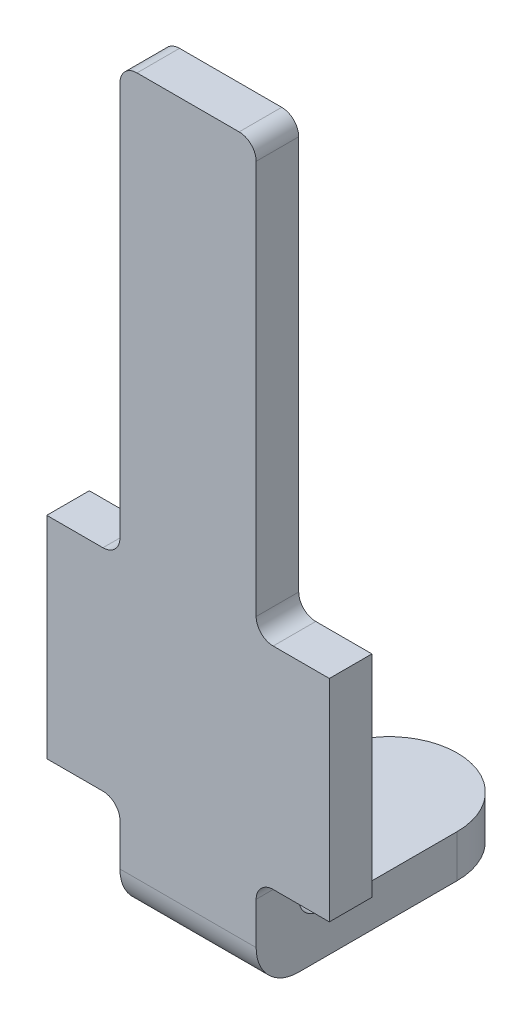
ISO-10303-21;
HEADER;
FILE_DESCRIPTION(('STEP AP214'),'2;1');
FILE_NAME('part.step','',(''),(''),'','','');
FILE_SCHEMA(('AUTOMOTIVE_DESIGN { 1 0 10303 214 1 1 1 1 }'));
ENDSEC;
DATA;
#1=APPLICATION_CONTEXT('core data for automotive mechanical design processes');
#2=APPLICATION_PROTOCOL_DEFINITION('international standard','automotive_design',2000,#1);
#3=PRODUCT_CONTEXT('',#1,'mechanical');
#4=PRODUCT('Part','Part','',(#3));
#5=PRODUCT_RELATED_PRODUCT_CATEGORY('part','',(#4));
#6=PRODUCT_DEFINITION_FORMATION('','',#4);
#7=PRODUCT_DEFINITION_CONTEXT('part definition',#1,'design');
#8=PRODUCT_DEFINITION('design','',#6,#7);
#9=PRODUCT_DEFINITION_SHAPE('','',#8);
#10=(LENGTH_UNIT() NAMED_UNIT(*) SI_UNIT(.MILLI.,.METRE.));
#11=(NAMED_UNIT(*) PLANE_ANGLE_UNIT() SI_UNIT($,.RADIAN.));
#12=(NAMED_UNIT(*) SI_UNIT($,.STERADIAN.) SOLID_ANGLE_UNIT());
#13=UNCERTAINTY_MEASURE_WITH_UNIT(LENGTH_MEASURE(1.E-05),#10,'distance_accuracy_value','');
#14=(GEOMETRIC_REPRESENTATION_CONTEXT(3) GLOBAL_UNCERTAINTY_ASSIGNED_CONTEXT((#13)) GLOBAL_UNIT_ASSIGNED_CONTEXT((#10,
#11,#12)) REPRESENTATION_CONTEXT('',''));
#15=CARTESIAN_POINT('',(0.,0.,0.));
#16=DIRECTION('',(0.,0.,1.));
#17=DIRECTION('',(1.,0.,0.));
#18=AXIS2_PLACEMENT_3D('',#15,#16,#17);
#19=CARTESIAN_POINT('',(-9.39,1.48437551370885,-0.748999999999983));
#20=DIRECTION('',(0.,0.,-1.));
#21=DIRECTION('',(1.,0.,0.));
#22=AXIS2_PLACEMENT_3D('',#19,#20,#21);
#23=CYLINDRICAL_SURFACE('',#22,0.1);
#24=CARTESIAN_POINT('',(-9.39,1.48437551370885,-0.498999999999983));
#25=DIRECTION('',(0.,0.,1.));
#26=DIRECTION('',(1.,0.,0.));
#27=AXIS2_PLACEMENT_3D('',#24,#25,#26);
#28=CIRCLE('',#27,0.1);
#29=CARTESIAN_POINT('',(-9.39,1.38437551370885,-0.499000000000012));
#30=VERTEX_POINT('',#29);
#31=CARTESIAN_POINT('',(-9.29,1.48437551370885,-0.498999999999983));
#32=VERTEX_POINT('',#31);
#33=EDGE_CURVE('E336',#30,#32,#28,.T.);
#34=ORIENTED_EDGE('',*,*,#33,.T.);
#35=DIRECTION('',(0.,0.,-1.));
#36=VECTOR('',#35,1.);
#37=CARTESIAN_POINT('',(-9.29,1.48437551370885,-0.748999999999983));
#38=LINE('',#37,#36);
#39=CARTESIAN_POINT('',(-9.29,1.48437551370885,-0.748999999999983));
#40=VERTEX_POINT('',#39);
#41=EDGE_CURVE('E276',#32,#40,#38,.T.);
#42=ORIENTED_EDGE('',*,*,#41,.T.);
#43=CARTESIAN_POINT('',(-9.39,1.48437551370885,-0.748999999999983));
#44=DIRECTION('',(0.,0.,-1.));
#45=DIRECTION('',(-1.,0.,0.));
#46=AXIS2_PLACEMENT_3D('',#43,#44,#45);
#47=CIRCLE('',#46,0.1);
#48=CARTESIAN_POINT('',(-9.39,1.38437551370885,-0.749000000000012));
#49=VERTEX_POINT('',#48);
#50=EDGE_CURVE('E377',#40,#49,#47,.T.);
#51=ORIENTED_EDGE('',*,*,#50,.T.);
#52=DIRECTION('',(0.,0.,1.));
#53=VECTOR('',#52,1.);
#54=CARTESIAN_POINT('',(-9.39,1.38437551370885,-0.749000000000012));
#55=LINE('',#54,#53);
#56=EDGE_CURVE('E81',#49,#30,#55,.T.);
#57=ORIENTED_EDGE('',*,*,#56,.T.);
#58=EDGE_LOOP('',(#34,#42,#51,#57));
#59=FACE_BOUND('',#58,.T.);
#60=ADVANCED_FACE('F16',(#59),#23,.F.);
#61=CARTESIAN_POINT('',(-8.39,1.48437551370885,-0.749000000000014));
#62=DIRECTION('',(0.,0.,1.));
#63=DIRECTION('',(-1.,0.,0.));
#64=AXIS2_PLACEMENT_3D('',#61,#62,#63);
#65=CYLINDRICAL_SURFACE('',#64,0.1);
#66=CARTESIAN_POINT('',(-8.39,1.48437551370885,-0.498999999999985));
#67=DIRECTION('',(0.,0.,1.));
#68=DIRECTION('',(1.,0.,0.));
#69=AXIS2_PLACEMENT_3D('',#66,#67,#68);
#70=CIRCLE('',#69,0.1);
#71=CARTESIAN_POINT('',(-8.49,1.48437551370885,-0.498999999999984));
#72=VERTEX_POINT('',#71);
#73=CARTESIAN_POINT('',(-8.39,1.38437551370885,-0.499000000000013));
#74=VERTEX_POINT('',#73);
#75=EDGE_CURVE('E291',#72,#74,#70,.T.);
#76=ORIENTED_EDGE('',*,*,#75,.T.);
#77=DIRECTION('',(0.,0.,-1.));
#78=VECTOR('',#77,1.);
#79=CARTESIAN_POINT('',(-8.39,1.38437551370885,-0.748999999999984));
#80=LINE('',#79,#78);
#81=CARTESIAN_POINT('',(-8.39,1.38437551370885,-0.749000000000014));
#82=VERTEX_POINT('',#81);
#83=EDGE_CURVE('E42',#74,#82,#80,.T.);
#84=ORIENTED_EDGE('',*,*,#83,.T.);
#85=CARTESIAN_POINT('',(-8.39,1.48437551370885,-0.748999999999984));
#86=DIRECTION('',(0.,0.,-1.));
#87=DIRECTION('',(-1.,0.,0.));
#88=AXIS2_PLACEMENT_3D('',#85,#86,#87);
#89=CIRCLE('',#88,0.1);
#90=CARTESIAN_POINT('',(-8.49,1.48437551370885,-0.748999999999984));
#91=VERTEX_POINT('',#90);
#92=EDGE_CURVE('E239',#82,#91,#89,.T.);
#93=ORIENTED_EDGE('',*,*,#92,.T.);
#94=DIRECTION('',(0.,0.,1.));
#95=VECTOR('',#94,1.);
#96=CARTESIAN_POINT('',(-8.49,1.48437551370885,-0.498999999999984));
#97=LINE('',#96,#95);
#98=EDGE_CURVE('E385',#91,#72,#97,.T.);
#99=ORIENTED_EDGE('',*,*,#98,.T.);
#100=EDGE_LOOP('',(#76,#84,#93,#99));
#101=FACE_BOUND('',#100,.T.);
#102=ADVANCED_FACE('F503',(#101),#65,.F.);
#103=CARTESIAN_POINT('',(-9.39,0.0459658151929143,-0.749000000000012));
#104=DIRECTION('',(0.,0.,1.));
#105=DIRECTION('',(-1.,0.,0.));
#106=AXIS2_PLACEMENT_3D('',#103,#104,#105);
#107=CYLINDRICAL_SURFACE('',#106,0.1);
#108=CARTESIAN_POINT('',(-9.39,0.0459658151929143,-0.498999999999983));
#109=DIRECTION('',(0.,0.,1.));
#110=DIRECTION('',(1.,0.,0.));
#111=AXIS2_PLACEMENT_3D('',#108,#109,#110);
#112=CIRCLE('',#111,0.1);
#113=CARTESIAN_POINT('',(-9.29,0.0459658151929143,-0.498999999999983));
#114=VERTEX_POINT('',#113);
#115=CARTESIAN_POINT('',(-9.39,0.145965815192914,-0.499000000000012));
#116=VERTEX_POINT('',#115);
#117=EDGE_CURVE('E394',#114,#116,#112,.T.);
#118=ORIENTED_EDGE('',*,*,#117,.T.);
#119=DIRECTION('',(0.,0.,-1.));
#120=VECTOR('',#119,1.);
#121=CARTESIAN_POINT('',(-9.39,0.145965815192914,-0.748999999999983));
#122=LINE('',#121,#120);
#123=CARTESIAN_POINT('',(-9.39,0.145965815192914,-0.749000000000012));
#124=VERTEX_POINT('',#123);
#125=EDGE_CURVE('E263',#116,#124,#122,.T.);
#126=ORIENTED_EDGE('',*,*,#125,.T.);
#127=CARTESIAN_POINT('',(-9.39,0.0459658151929143,-0.748999999999983));
#128=DIRECTION('',(0.,0.,-1.));
#129=DIRECTION('',(-1.,0.,0.));
#130=AXIS2_PLACEMENT_3D('',#127,#128,#129);
#131=CIRCLE('',#130,0.1);
#132=CARTESIAN_POINT('',(-9.29,0.0459658151929143,-0.748999999999983));
#133=VERTEX_POINT('',#132);
#134=EDGE_CURVE('E373',#124,#133,#131,.T.);
#135=ORIENTED_EDGE('',*,*,#134,.T.);
#136=DIRECTION('',(0.,0.,1.));
#137=VECTOR('',#136,1.);
#138=CARTESIAN_POINT('',(-9.29,0.0459658151929143,-0.499000000000012));
#139=LINE('',#138,#137);
#140=EDGE_CURVE('E312',#133,#114,#139,.T.);
#141=ORIENTED_EDGE('',*,*,#140,.T.);
#142=EDGE_LOOP('',(#118,#126,#135,#141));
#143=FACE_BOUND('',#142,.T.);
#144=ADVANCED_FACE('F497',(#143),#107,.F.);
#145=CARTESIAN_POINT('',(-8.39,0.0459658151929143,-0.748999999999984));
#146=DIRECTION('',(0.,0.,-1.));
#147=DIRECTION('',(1.,0.,0.));
#148=AXIS2_PLACEMENT_3D('',#145,#146,#147);
#149=CYLINDRICAL_SURFACE('',#148,0.1);
#150=CARTESIAN_POINT('',(-8.39,0.0459658151929143,-0.498999999999984));
#151=DIRECTION('',(0.,0.,1.));
#152=DIRECTION('',(1.,0.,0.));
#153=AXIS2_PLACEMENT_3D('',#150,#151,#152);
#154=CIRCLE('',#153,0.1);
#155=CARTESIAN_POINT('',(-8.39,0.145965815192914,-0.499000000000013));
#156=VERTEX_POINT('',#155);
#157=CARTESIAN_POINT('',(-8.49,0.0459658151929143,-0.498999999999984));
#158=VERTEX_POINT('',#157);
#159=EDGE_CURVE('E270',#156,#158,#154,.T.);
#160=ORIENTED_EDGE('',*,*,#159,.T.);
#161=DIRECTION('',(0.,0.,-1.));
#162=VECTOR('',#161,1.);
#163=CARTESIAN_POINT('',(-8.49,0.0459658151929143,-0.748999999999984));
#164=LINE('',#163,#162);
#165=CARTESIAN_POINT('',(-8.49,0.0459658151929143,-0.748999999999984));
#166=VERTEX_POINT('',#165);
#167=EDGE_CURVE('E261',#158,#166,#164,.T.);
#168=ORIENTED_EDGE('',*,*,#167,.T.);
#169=CARTESIAN_POINT('',(-8.39,0.0459658151929143,-0.748999999999984));
#170=DIRECTION('',(0.,0.,-1.));
#171=DIRECTION('',(-1.,0.,0.));
#172=AXIS2_PLACEMENT_3D('',#169,#170,#171);
#173=CIRCLE('',#172,0.1);
#174=CARTESIAN_POINT('',(-8.39,0.145965815192914,-0.749000000000013));
#175=VERTEX_POINT('',#174);
#176=EDGE_CURVE('E313',#166,#175,#173,.T.);
#177=ORIENTED_EDGE('',*,*,#176,.T.);
#178=DIRECTION('',(0.,0.,1.));
#179=VECTOR('',#178,1.);
#180=CARTESIAN_POINT('',(-8.39,0.145965815192914,-0.749000000000013));
#181=LINE('',#180,#179);
#182=EDGE_CURVE('E11',#175,#156,#181,.T.);
#183=ORIENTED_EDGE('',*,*,#182,.T.);
#184=EDGE_LOOP('',(#160,#168,#177,#183));
#185=FACE_BOUND('',#184,.T.);
#186=ADVANCED_FACE('F488',(#185),#149,.F.);
#187=CARTESIAN_POINT('',(-9.19,3.8,-0.748999999999983));
#188=DIRECTION('',(0.,0.,1.));
#189=DIRECTION('',(-1.,0.,0.));
#190=AXIS2_PLACEMENT_3D('',#187,#188,#189);
#191=CYLINDRICAL_SURFACE('',#190,0.1);
#192=CARTESIAN_POINT('',(-9.19,3.8,-0.498999999999984));
#193=DIRECTION('',(0.,0.,-1.));
#194=DIRECTION('',(1.,0.,0.));
#195=AXIS2_PLACEMENT_3D('',#192,#193,#194);
#196=CIRCLE('',#195,0.1);
#197=CARTESIAN_POINT('',(-9.29,3.8,-0.498999999999984));
#198=VERTEX_POINT('',#197);
#199=CARTESIAN_POINT('',(-9.19,3.9,-0.498999999999984));
#200=VERTEX_POINT('',#199);
#201=EDGE_CURVE('E340',#198,#200,#196,.T.);
#202=ORIENTED_EDGE('',*,*,#201,.T.);
#203=DIRECTION('',(0.,0.,-1.));
#204=VECTOR('',#203,1.);
#205=CARTESIAN_POINT('',(-9.19,3.9,-0.748999999999983));
#206=LINE('',#205,#204);
#207=CARTESIAN_POINT('',(-9.19,3.9,-0.748999999999983));
#208=VERTEX_POINT('',#207);
#209=EDGE_CURVE('E246',#200,#208,#206,.T.);
#210=ORIENTED_EDGE('',*,*,#209,.T.);
#211=CARTESIAN_POINT('',(-9.19,3.8,-0.748999999999983));
#212=DIRECTION('',(0.,0.,1.));
#213=DIRECTION('',(-1.,0.,0.));
#214=AXIS2_PLACEMENT_3D('',#211,#212,#213);
#215=CIRCLE('',#214,0.1);
#216=CARTESIAN_POINT('',(-9.29,3.8,-0.748999999999983));
#217=VERTEX_POINT('',#216);
#218=EDGE_CURVE('E230',#208,#217,#215,.T.);
#219=ORIENTED_EDGE('',*,*,#218,.T.);
#220=DIRECTION('',(0.,0.,1.));
#221=VECTOR('',#220,1.);
#222=CARTESIAN_POINT('',(-9.29,3.8,-0.498999999999984));
#223=LINE('',#222,#221);
#224=EDGE_CURVE('E247',#217,#198,#223,.T.);
#225=ORIENTED_EDGE('',*,*,#224,.T.);
#226=EDGE_LOOP('',(#202,#210,#219,#225));
#227=FACE_BOUND('',#226,.T.);
#228=ADVANCED_FACE('F486',(#227),#191,.T.);
#229=CARTESIAN_POINT('',(-8.59,3.8,-0.748999999999984));
#230=DIRECTION('',(0.,0.,-1.));
#231=DIRECTION('',(1.,0.,0.));
#232=AXIS2_PLACEMENT_3D('',#229,#230,#231);
#233=CYLINDRICAL_SURFACE('',#232,0.1);
#234=CARTESIAN_POINT('',(-8.59,3.8,-0.498999999999985));
#235=DIRECTION('',(0.,0.,-1.));
#236=DIRECTION('',(1.,0.,0.));
#237=AXIS2_PLACEMENT_3D('',#234,#235,#236);
#238=CIRCLE('',#237,0.1);
#239=CARTESIAN_POINT('',(-8.59,3.9,-0.498999999999985));
#240=VERTEX_POINT('',#239);
#241=CARTESIAN_POINT('',(-8.49,3.8,-0.498999999999985));
#242=VERTEX_POINT('',#241);
#243=EDGE_CURVE('E288',#240,#242,#238,.T.);
#244=ORIENTED_EDGE('',*,*,#243,.T.);
#245=DIRECTION('',(0.,0.,-1.));
#246=VECTOR('',#245,1.);
#247=CARTESIAN_POINT('',(-8.49,3.8,-0.748999999999984));
#248=LINE('',#247,#246);
#249=CARTESIAN_POINT('',(-8.49,3.8,-0.748999999999984));
#250=VERTEX_POINT('',#249);
#251=EDGE_CURVE('E223',#242,#250,#248,.T.);
#252=ORIENTED_EDGE('',*,*,#251,.T.);
#253=CARTESIAN_POINT('',(-8.59,3.8,-0.748999999999984));
#254=DIRECTION('',(0.,0.,1.));
#255=DIRECTION('',(-1.,0.,0.));
#256=AXIS2_PLACEMENT_3D('',#253,#254,#255);
#257=CIRCLE('',#256,0.1);
#258=CARTESIAN_POINT('',(-8.59,3.9,-0.748999999999984));
#259=VERTEX_POINT('',#258);
#260=EDGE_CURVE('E217',#250,#259,#257,.T.);
#261=ORIENTED_EDGE('',*,*,#260,.T.);
#262=DIRECTION('',(0.,0.,1.));
#263=VECTOR('',#262,1.);
#264=CARTESIAN_POINT('',(-8.59,3.9,-0.748999999999984));
#265=LINE('',#264,#263);
#266=EDGE_CURVE('E220',#259,#240,#265,.T.);
#267=ORIENTED_EDGE('',*,*,#266,.T.);
#268=EDGE_LOOP('',(#244,#252,#261,#267));
#269=FACE_BOUND('',#268,.T.);
#270=ADVANCED_FACE('F219',(#269),#233,.T.);
#271=CARTESIAN_POINT('',(-8.06,0.,-1.00308650274883E-13));
#272=DIRECTION('',(-1.,0.,0.));
#273=DIRECTION('',(0.,1.,0.));
#274=AXIS2_PLACEMENT_3D('',#271,#272,#273);
#275=PLANE('',#274);
#276=DIRECTION('',(0.,0.,1.));
#277=VECTOR('',#276,1.);
#278=CARTESIAN_POINT('',(-8.06,1.38437551370885,-0.749000000000014));
#279=LINE('',#278,#277);
#280=CARTESIAN_POINT('',(-8.06,1.38437551370885,-0.749000000000014));
#281=VERTEX_POINT('',#280);
#282=CARTESIAN_POINT('',(-8.06,1.38437551370885,-0.499000000000014));
#283=VERTEX_POINT('',#282);
#284=EDGE_CURVE('E328',#281,#283,#279,.T.);
#285=ORIENTED_EDGE('',*,*,#284,.T.);
#286=DIRECTION('',(0.,-1.,0.));
#287=VECTOR('',#286,1.);
#288=CARTESIAN_POINT('',(-8.06,1.38437551370885,-0.499000000000014));
#289=LINE('',#288,#287);
#290=CARTESIAN_POINT('',(-8.06,0.145965815192914,-0.499000000000014));
#291=VERTEX_POINT('',#290);
#292=EDGE_CURVE('E384',#283,#291,#289,.T.);
#293=ORIENTED_EDGE('',*,*,#292,.T.);
#294=DIRECTION('',(0.,0.,1.));
#295=VECTOR('',#294,1.);
#296=CARTESIAN_POINT('',(-8.06,0.145965815192914,-0.749000000000014));
#297=LINE('',#296,#295);
#298=CARTESIAN_POINT('',(-8.06,0.145965815192914,-0.749000000000014));
#299=VERTEX_POINT('',#298);
#300=EDGE_CURVE('E27',#299,#291,#297,.T.);
#301=ORIENTED_EDGE('',*,*,#300,.F.);
#302=DIRECTION('',(0.,-1.,0.));
#303=VECTOR('',#302,1.);
#304=CARTESIAN_POINT('',(-8.06,1.38437551370885,-0.749000000000014));
#305=LINE('',#304,#303);
#306=EDGE_CURVE('E303',#281,#299,#305,.T.);
#307=ORIENTED_EDGE('',*,*,#306,.F.);
#308=EDGE_LOOP('',(#285,#293,#301,#307));
#309=FACE_BOUND('',#308,.T.);
#310=ADVANCED_FACE('F495',(#309),#275,.F.);
#311=CARTESIAN_POINT('',(-9.72,0.145965815192914,-0.749000000000011));
#312=DIRECTION('',(0.,-1.,0.));
#313=DIRECTION('',(0.,0.,-1.));
#314=AXIS2_PLACEMENT_3D('',#311,#312,#313);
#315=PLANE('',#314);
#316=DIRECTION('',(1.,0.,0.));
#317=VECTOR('',#316,1.);
#318=CARTESIAN_POINT('',(-9.72,0.145965815192914,-0.749000000000011));
#319=LINE('',#318,#317);
#320=EDGE_CURVE('E307',#175,#299,#319,.T.);
#321=ORIENTED_EDGE('',*,*,#320,.T.);
#322=ORIENTED_EDGE('',*,*,#300,.T.);
#323=DIRECTION('',(1.,0.,0.));
#324=VECTOR('',#323,1.);
#325=CARTESIAN_POINT('',(-9.72,0.145965815192914,-0.499000000000011));
#326=LINE('',#325,#324);
#327=EDGE_CURVE('E335',#156,#291,#326,.T.);
#328=ORIENTED_EDGE('',*,*,#327,.F.);
#329=ORIENTED_EDGE('',*,*,#182,.F.);
#330=EDGE_LOOP('',(#321,#322,#328,#329));
#331=FACE_BOUND('',#330,.T.);
#332=ADVANCED_FACE('F542',(#331),#315,.T.);
#333=CARTESIAN_POINT('',(-9.72,1.38437551370885,-0.749000000000012));
#334=DIRECTION('',(0.,-1.,0.));
#335=DIRECTION('',(0.,0.,-1.));
#336=AXIS2_PLACEMENT_3D('',#333,#334,#335);
#337=PLANE('',#336);
#338=DIRECTION('',(1.,0.,0.));
#339=VECTOR('',#338,1.);
#340=CARTESIAN_POINT('',(-9.72,1.38437551370885,-0.499000000000011));
#341=LINE('',#340,#339);
#342=EDGE_CURVE('E20',#74,#283,#341,.T.);
#343=ORIENTED_EDGE('',*,*,#342,.T.);
#344=ORIENTED_EDGE('',*,*,#284,.F.);
#345=DIRECTION('',(1.,0.,0.));
#346=VECTOR('',#345,1.);
#347=CARTESIAN_POINT('',(-9.72,1.38437551370885,-0.749000000000012));
#348=LINE('',#347,#346);
#349=EDGE_CURVE('E308',#82,#281,#348,.T.);
#350=ORIENTED_EDGE('',*,*,#349,.F.);
#351=ORIENTED_EDGE('',*,*,#83,.F.);
#352=EDGE_LOOP('',(#343,#344,#350,#351));
#353=FACE_BOUND('',#352,.T.);
#354=ADVANCED_FACE('F516',(#353),#337,.F.);
#355=CARTESIAN_POINT('',(-9.72,1.38437551370885,-0.749000000000012));
#356=DIRECTION('',(0.,-1.,0.));
#357=DIRECTION('',(0.,0.,-1.));
#358=AXIS2_PLACEMENT_3D('',#355,#356,#357);
#359=PLANE('',#358);
#360=DIRECTION('',(1.,0.,0.));
#361=VECTOR('',#360,1.);
#362=CARTESIAN_POINT('',(-9.72,1.38437551370885,-0.749000000000012));
#363=LINE('',#362,#361);
#364=CARTESIAN_POINT('',(-9.72,1.38437551370885,-0.749000000000012));
#365=VERTEX_POINT('',#364);
#366=EDGE_CURVE('E422',#365,#49,#363,.T.);
#367=ORIENTED_EDGE('',*,*,#366,.F.);
#368=DIRECTION('',(0.,0.,1.));
#369=VECTOR('',#368,1.);
#370=CARTESIAN_POINT('',(-9.72,1.38437551370885,-0.749000000000012));
#371=LINE('',#370,#369);
#372=CARTESIAN_POINT('',(-9.72,1.38437551370885,-0.499000000000011));
#373=VERTEX_POINT('',#372);
#374=EDGE_CURVE('E309',#365,#373,#371,.T.);
#375=ORIENTED_EDGE('',*,*,#374,.T.);
#376=DIRECTION('',(1.,0.,0.));
#377=VECTOR('',#376,1.);
#378=CARTESIAN_POINT('',(-9.72,1.38437551370885,-0.499000000000011));
#379=LINE('',#378,#377);
#380=EDGE_CURVE('E339',#373,#30,#379,.T.);
#381=ORIENTED_EDGE('',*,*,#380,.T.);
#382=ORIENTED_EDGE('',*,*,#56,.F.);
#383=EDGE_LOOP('',(#367,#375,#381,#382));
#384=FACE_BOUND('',#383,.T.);
#385=ADVANCED_FACE('F468',(#384),#359,.F.);
#386=CARTESIAN_POINT('',(-9.72,0.145965815192914,-0.749000000000011));
#387=DIRECTION('',(0.,-1.,0.));
#388=DIRECTION('',(0.,0.,-1.));
#389=AXIS2_PLACEMENT_3D('',#386,#387,#388);
#390=PLANE('',#389);
#391=DIRECTION('',(1.,0.,0.));
#392=VECTOR('',#391,1.);
#393=CARTESIAN_POINT('',(-9.72,0.145965815192914,-0.499000000000011));
#394=LINE('',#393,#392);
#395=CARTESIAN_POINT('',(-9.72,0.145965815192914,-0.499000000000011));
#396=VERTEX_POINT('',#395);
#397=EDGE_CURVE('E390',#396,#116,#394,.T.);
#398=ORIENTED_EDGE('',*,*,#397,.F.);
#399=DIRECTION('',(0.,0.,1.));
#400=VECTOR('',#399,1.);
#401=CARTESIAN_POINT('',(-9.72,0.145965815192914,-0.749000000000011));
#402=LINE('',#401,#400);
#403=CARTESIAN_POINT('',(-9.72,0.145965815192914,-0.749000000000011));
#404=VERTEX_POINT('',#403);
#405=EDGE_CURVE('E265',#404,#396,#402,.T.);
#406=ORIENTED_EDGE('',*,*,#405,.F.);
#407=DIRECTION('',(1.,0.,0.));
#408=VECTOR('',#407,1.);
#409=CARTESIAN_POINT('',(-9.72,0.145965815192914,-0.749000000000011));
#410=LINE('',#409,#408);
#411=EDGE_CURVE('E369',#404,#124,#410,.T.);
#412=ORIENTED_EDGE('',*,*,#411,.T.);
#413=ORIENTED_EDGE('',*,*,#125,.F.);
#414=EDGE_LOOP('',(#398,#406,#412,#413));
#415=FACE_BOUND('',#414,.T.);
#416=ADVANCED_FACE('F515',(#415),#390,.T.);
#417=CARTESIAN_POINT('',(-9.72,0.,0.));
#418=DIRECTION('',(-1.,0.,0.));
#419=DIRECTION('',(0.,1.,0.));
#420=AXIS2_PLACEMENT_3D('',#417,#418,#419);
#421=PLANE('',#420);
#422=ORIENTED_EDGE('',*,*,#374,.F.);
#423=DIRECTION('',(0.,-1.,0.));
#424=VECTOR('',#423,1.);
#425=CARTESIAN_POINT('',(-9.72,1.38437551370885,-0.749000000000012));
#426=LINE('',#425,#424);
#427=EDGE_CURVE('E372',#365,#404,#426,.T.);
#428=ORIENTED_EDGE('',*,*,#427,.T.);
#429=ORIENTED_EDGE('',*,*,#405,.T.);
#430=DIRECTION('',(0.,-1.,0.));
#431=VECTOR('',#430,1.);
#432=CARTESIAN_POINT('',(-9.72,1.38437551370885,-0.499000000000011));
#433=LINE('',#432,#431);
#434=EDGE_CURVE('E348',#373,#396,#433,.T.);
#435=ORIENTED_EDGE('',*,*,#434,.F.);
#436=EDGE_LOOP('',(#422,#428,#429,#435));
#437=FACE_BOUND('',#436,.T.);
#438=ADVANCED_FACE('F472',(#437),#421,.T.);
#439=CARTESIAN_POINT('',(-8.89,-0.2,-1.68));
#440=DIRECTION('',(0.,-1.,0.));
#441=DIRECTION('',(0.,0.,1.));
#442=AXIS2_PLACEMENT_3D('',#439,#440,#441);
#443=CYLINDRICAL_SURFACE('',#442,0.4);
#444=DIRECTION('',(0.,-1.,0.));
#445=VECTOR('',#444,1.);
#446=CARTESIAN_POINT('',(-8.49,-0.2,-1.68));
#447=LINE('',#446,#445);
#448=CARTESIAN_POINT('',(-8.49,-0.2,-1.68));
#449=VERTEX_POINT('',#448);
#450=CARTESIAN_POINT('',(-8.49,-0.45,-1.68));
#451=VERTEX_POINT('',#450);
#452=EDGE_CURVE('E290',#449,#451,#447,.T.);
#453=ORIENTED_EDGE('',*,*,#452,.T.);
#454=CARTESIAN_POINT('',(-8.89,-0.45,-1.68));
#455=DIRECTION('',(0.,1.,0.));
#456=DIRECTION('',(0.,0.,-1.));
#457=AXIS2_PLACEMENT_3D('',#454,#455,#456);
#458=CIRCLE('',#457,0.4);
#459=CARTESIAN_POINT('',(-9.29,-0.45,-1.68));
#460=VERTEX_POINT('',#459);
#461=EDGE_CURVE('E415',#451,#460,#458,.T.);
#462=ORIENTED_EDGE('',*,*,#461,.T.);
#463=DIRECTION('',(0.,1.,0.));
#464=VECTOR('',#463,1.);
#465=CARTESIAN_POINT('',(-9.29,-0.2,-1.68));
#466=LINE('',#465,#464);
#467=CARTESIAN_POINT('',(-9.29,-0.2,-1.68));
#468=VERTEX_POINT('',#467);
#469=EDGE_CURVE('E151',#460,#468,#466,.T.);
#470=ORIENTED_EDGE('',*,*,#469,.T.);
#471=CARTESIAN_POINT('',(-8.89,-0.2,-1.68));
#472=DIRECTION('',(0.,-1.,0.));
#473=DIRECTION('',(0.,0.,1.));
#474=AXIS2_PLACEMENT_3D('',#471,#472,#473);
#475=CIRCLE('',#474,0.4);
#476=EDGE_CURVE('E408',#468,#449,#475,.T.);
#477=ORIENTED_EDGE('',*,*,#476,.T.);
#478=EDGE_LOOP('',(#453,#462,#470,#477));
#479=FACE_BOUND('',#478,.T.);
#480=ADVANCED_FACE('F523',(#479),#443,.T.);
#481=CARTESIAN_POINT('',(-9.29,-0.2,-0.748999999999983));
#482=DIRECTION('',(-1.,0.,0.));
#483=DIRECTION('',(0.,1.,0.));
#484=AXIS2_PLACEMENT_3D('',#481,#482,#483);
#485=PLANE('',#484);
#486=DIRECTION('',(0.,-1.,0.));
#487=VECTOR('',#486,1.);
#488=CARTESIAN_POINT('',(-9.29,3.9,-0.748999999999983));
#489=LINE('',#488,#487);
#490=CARTESIAN_POINT('',(-9.29,-0.0749999999999988,-0.748999999999983));
#491=VERTEX_POINT('',#490);
#492=EDGE_CURVE('E400',#133,#491,#489,.T.);
#493=ORIENTED_EDGE('',*,*,#492,.T.);
#494=CARTESIAN_POINT('',(-9.29,-0.0749999999999988,-0.873999999999983));
#495=DIRECTION('',(1.,0.,0.));
#496=DIRECTION('',(0.,0.,-1.));
#497=AXIS2_PLACEMENT_3D('',#494,#495,#496);
#498=CIRCLE('',#497,0.125);
#499=CARTESIAN_POINT('',(-9.29,-0.2,-0.873999999999983));
#500=VERTEX_POINT('',#499);
#501=EDGE_CURVE('E229',#491,#500,#498,.T.);
#502=ORIENTED_EDGE('',*,*,#501,.T.);
#503=DIRECTION('',(0.,0.,-1.));
#504=VECTOR('',#503,1.);
#505=CARTESIAN_POINT('',(-9.29,-0.2,-0.873999999999983));
#506=LINE('',#505,#504);
#507=EDGE_CURVE('E63',#500,#468,#506,.T.);
#508=ORIENTED_EDGE('',*,*,#507,.T.);
#509=ORIENTED_EDGE('',*,*,#469,.F.);
#510=DIRECTION('',(0.,0.,1.));
#511=VECTOR('',#510,1.);
#512=CARTESIAN_POINT('',(-9.29,-0.45,-0.748999999999983));
#513=LINE('',#512,#511);
#514=CARTESIAN_POINT('',(-9.29,-0.45,-0.748999999999983));
#515=VERTEX_POINT('',#514);
#516=EDGE_CURVE('E284',#460,#515,#513,.T.);
#517=ORIENTED_EDGE('',*,*,#516,.T.);
#518=CARTESIAN_POINT('',(-9.29,-0.2,-0.748999999999983));
#519=DIRECTION('',(-1.,0.,0.));
#520=DIRECTION('',(0.,0.,-1.));
#521=AXIS2_PLACEMENT_3D('',#518,#519,#520);
#522=CIRCLE('',#521,0.25);
#523=CARTESIAN_POINT('',(-9.29,-0.2,-0.498999999999983));
#524=VERTEX_POINT('',#523);
#525=EDGE_CURVE('E280',#515,#524,#522,.T.);
#526=ORIENTED_EDGE('',*,*,#525,.T.);
#527=DIRECTION('',(0.,1.,0.));
#528=VECTOR('',#527,1.);
#529=CARTESIAN_POINT('',(-9.29,3.9,-0.498999999999984));
#530=LINE('',#529,#528);
#531=EDGE_CURVE('E271',#524,#114,#530,.T.);
#532=ORIENTED_EDGE('',*,*,#531,.T.);
#533=ORIENTED_EDGE('',*,*,#140,.F.);
#534=EDGE_LOOP('',(#493,#502,#508,#509,#517,#526,#532,#533));
#535=FACE_BOUND('',#534,.T.);
#536=ADVANCED_FACE('F541',(#535),#485,.T.);
#537=CARTESIAN_POINT('',(-8.49,-0.2,-0.748999999999984));
#538=DIRECTION('',(-1.,0.,0.));
#539=DIRECTION('',(0.,1.,0.));
#540=AXIS2_PLACEMENT_3D('',#537,#538,#539);
#541=PLANE('',#540);
#542=DIRECTION('',(0.,1.,0.));
#543=VECTOR('',#542,1.);
#544=CARTESIAN_POINT('',(-8.49,3.9,-0.498999999999985));
#545=LINE('',#544,#543);
#546=CARTESIAN_POINT('',(-8.49,-0.2,-0.498999999999984));
#547=VERTEX_POINT('',#546);
#548=EDGE_CURVE('E266',#547,#158,#545,.T.);
#549=ORIENTED_EDGE('',*,*,#548,.F.);
#550=CARTESIAN_POINT('',(-8.49,-0.2,-0.748999999999984));
#551=DIRECTION('',(-1.,0.,0.));
#552=DIRECTION('',(0.,0.,-1.));
#553=AXIS2_PLACEMENT_3D('',#550,#551,#552);
#554=CIRCLE('',#553,0.25);
#555=CARTESIAN_POINT('',(-8.49,-0.45,-0.748999999999984));
#556=VERTEX_POINT('',#555);
#557=EDGE_CURVE('E165',#556,#547,#554,.T.);
#558=ORIENTED_EDGE('',*,*,#557,.F.);
#559=DIRECTION('',(0.,0.,1.));
#560=VECTOR('',#559,1.);
#561=CARTESIAN_POINT('',(-8.49,-0.45,-0.748999999999984));
#562=LINE('',#561,#560);
#563=EDGE_CURVE('E299',#451,#556,#562,.T.);
#564=ORIENTED_EDGE('',*,*,#563,.F.);
#565=ORIENTED_EDGE('',*,*,#452,.F.);
#566=DIRECTION('',(0.,0.,-1.));
#567=VECTOR('',#566,1.);
#568=CARTESIAN_POINT('',(-8.49,-0.2,-0.873999999999984));
#569=LINE('',#568,#567);
#570=CARTESIAN_POINT('',(-8.49,-0.2,-0.873999999999984));
#571=VERTEX_POINT('',#570);
#572=EDGE_CURVE('E325',#571,#449,#569,.T.);
#573=ORIENTED_EDGE('',*,*,#572,.F.);
#574=CARTESIAN_POINT('',(-8.49,-0.0749999999999988,-0.873999999999984));
#575=DIRECTION('',(1.,0.,0.));
#576=DIRECTION('',(0.,0.,-1.));
#577=AXIS2_PLACEMENT_3D('',#574,#575,#576);
#578=CIRCLE('',#577,0.125);
#579=CARTESIAN_POINT('',(-8.49,-0.0749999999999988,-0.748999999999984));
#580=VERTEX_POINT('',#579);
#581=EDGE_CURVE('E318',#580,#571,#578,.T.);
#582=ORIENTED_EDGE('',*,*,#581,.F.);
#583=DIRECTION('',(0.,-1.,0.));
#584=VECTOR('',#583,1.);
#585=CARTESIAN_POINT('',(-8.49,3.9,-0.748999999999984));
#586=LINE('',#585,#584);
#587=EDGE_CURVE('E316',#166,#580,#586,.T.);
#588=ORIENTED_EDGE('',*,*,#587,.F.);
#589=ORIENTED_EDGE('',*,*,#167,.F.);
#590=EDGE_LOOP('',(#549,#558,#564,#565,#573,#582,#588,#589));
#591=FACE_BOUND('',#590,.T.);
#592=ADVANCED_FACE('F538',(#591),#541,.F.);
#593=CARTESIAN_POINT('',(-8.49,3.9,-0.498999999999985));
#594=DIRECTION('',(0.,0.,-1.));
#595=DIRECTION('',(-1.,0.,0.));
#596=AXIS2_PLACEMENT_3D('',#593,#594,#595);
#597=PLANE('',#596);
#598=DIRECTION('',(-1.,0.,0.));
#599=VECTOR('',#598,1.);
#600=CARTESIAN_POINT('',(-8.49,3.9,-0.498999999999985));
#601=LINE('',#600,#599);
#602=EDGE_CURVE('E237',#240,#200,#601,.T.);
#603=ORIENTED_EDGE('',*,*,#602,.T.);
#604=ORIENTED_EDGE('',*,*,#201,.F.);
#605=DIRECTION('',(0.,1.,0.));
#606=VECTOR('',#605,1.);
#607=CARTESIAN_POINT('',(-9.29,3.9,-0.498999999999984));
#608=LINE('',#607,#606);
#609=EDGE_CURVE('E257',#32,#198,#608,.T.);
#610=ORIENTED_EDGE('',*,*,#609,.F.);
#611=ORIENTED_EDGE('',*,*,#33,.F.);
#612=ORIENTED_EDGE('',*,*,#380,.F.);
#613=ORIENTED_EDGE('',*,*,#434,.T.);
#614=ORIENTED_EDGE('',*,*,#397,.T.);
#615=ORIENTED_EDGE('',*,*,#117,.F.);
#616=ORIENTED_EDGE('',*,*,#531,.F.);
#617=DIRECTION('',(-1.,0.,0.));
#618=VECTOR('',#617,1.);
#619=CARTESIAN_POINT('',(-8.49,-0.2,-0.498999999999984));
#620=LINE('',#619,#618);
#621=EDGE_CURVE('E287',#547,#524,#620,.T.);
#622=ORIENTED_EDGE('',*,*,#621,.F.);
#623=ORIENTED_EDGE('',*,*,#548,.T.);
#624=ORIENTED_EDGE('',*,*,#159,.F.);
#625=ORIENTED_EDGE('',*,*,#327,.T.);
#626=ORIENTED_EDGE('',*,*,#292,.F.);
#627=ORIENTED_EDGE('',*,*,#342,.F.);
#628=ORIENTED_EDGE('',*,*,#75,.F.);
#629=DIRECTION('',(0.,1.,0.));
#630=VECTOR('',#629,1.);
#631=CARTESIAN_POINT('',(-8.49,3.9,-0.498999999999985));
#632=LINE('',#631,#630);
#633=EDGE_CURVE('E389',#72,#242,#632,.T.);
#634=ORIENTED_EDGE('',*,*,#633,.T.);
#635=ORIENTED_EDGE('',*,*,#243,.F.);
#636=EDGE_LOOP('',(#603,#604,#610,#611,#612,#613,#614,#615,#616,#622,#623,#624,#625,#626,#627,
#628,#634,#635));
#637=FACE_BOUND('',#636,.T.);
#638=ADVANCED_FACE('F476',(#637),#597,.F.);
#639=CARTESIAN_POINT('',(-8.49,-0.2,-0.748999999999984));
#640=DIRECTION('',(-1.,0.,0.));
#641=DIRECTION('',(0.,0.,-1.));
#642=AXIS2_PLACEMENT_3D('',#639,#640,#641);
#643=CYLINDRICAL_SURFACE('',#642,0.25);
#644=ORIENTED_EDGE('',*,*,#525,.F.);
#645=DIRECTION('',(-1.,0.,0.));
#646=VECTOR('',#645,1.);
#647=CARTESIAN_POINT('',(-8.49,-0.45,-0.748999999999984));
#648=LINE('',#647,#646);
#649=EDGE_CURVE('E295',#556,#515,#648,.T.);
#650=ORIENTED_EDGE('',*,*,#649,.F.);
#651=ORIENTED_EDGE('',*,*,#557,.T.);
#652=ORIENTED_EDGE('',*,*,#621,.T.);
#653=EDGE_LOOP('',(#644,#650,#651,#652));
#654=FACE_BOUND('',#653,.T.);
#655=ADVANCED_FACE('F517',(#654),#643,.T.);
#656=CARTESIAN_POINT('',(-8.49,-0.45,-0.748999999999984));
#657=DIRECTION('',(0.,1.,0.));
#658=DIRECTION('',(0.,0.,-1.));
#659=AXIS2_PLACEMENT_3D('',#656,#657,#658);
#660=PLANE('',#659);
#661=ORIENTED_EDGE('',*,*,#461,.F.);
#662=ORIENTED_EDGE('',*,*,#563,.T.);
#663=ORIENTED_EDGE('',*,*,#649,.T.);
#664=ORIENTED_EDGE('',*,*,#516,.F.);
#665=EDGE_LOOP('',(#661,#662,#663,#664));
#666=FACE_BOUND('',#665,.T.);
#667=ADVANCED_FACE('F520',(#666),#660,.F.);
#668=CARTESIAN_POINT('',(-8.49,-0.2,-0.873999999999984));
#669=DIRECTION('',(0.,-1.,0.));
#670=DIRECTION('',(-1.,0.,0.));
#671=AXIS2_PLACEMENT_3D('',#668,#669,#670);
#672=PLANE('',#671);
#673=ORIENTED_EDGE('',*,*,#507,.F.);
#674=DIRECTION('',(-1.,0.,0.));
#675=VECTOR('',#674,1.);
#676=CARTESIAN_POINT('',(-8.49,-0.2,-0.873999999999984));
#677=LINE('',#676,#675);
#678=EDGE_CURVE('E322',#571,#500,#677,.T.);
#679=ORIENTED_EDGE('',*,*,#678,.F.);
#680=ORIENTED_EDGE('',*,*,#572,.T.);
#681=ORIENTED_EDGE('',*,*,#476,.F.);
#682=EDGE_LOOP('',(#673,#679,#680,#681));
#683=FACE_BOUND('',#682,.T.);
#684=ADVANCED_FACE('F510',(#683),#672,.F.);
#685=CARTESIAN_POINT('',(-8.49,-0.0749999999999988,-0.873999999999984));
#686=DIRECTION('',(-1.,0.,0.));
#687=DIRECTION('',(0.,0.,-1.));
#688=AXIS2_PLACEMENT_3D('',#685,#686,#687);
#689=CYLINDRICAL_SURFACE('',#688,0.125);
#690=ORIENTED_EDGE('',*,*,#501,.F.);
#691=DIRECTION('',(-1.,0.,0.));
#692=VECTOR('',#691,1.);
#693=CARTESIAN_POINT('',(-8.49,-0.0749999999999988,-0.748999999999984));
#694=LINE('',#693,#692);
#695=EDGE_CURVE('E403',#580,#491,#694,.T.);
#696=ORIENTED_EDGE('',*,*,#695,.F.);
#697=ORIENTED_EDGE('',*,*,#581,.T.);
#698=ORIENTED_EDGE('',*,*,#678,.T.);
#699=EDGE_LOOP('',(#690,#696,#697,#698));
#700=FACE_BOUND('',#699,.T.);
#701=ADVANCED_FACE('F525',(#700),#689,.F.);
#702=CARTESIAN_POINT('',(-8.49,3.9,-0.748999999999984));
#703=DIRECTION('',(0.,0.,1.));
#704=DIRECTION('',(1.,0.,0.));
#705=AXIS2_PLACEMENT_3D('',#702,#703,#704);
#706=PLANE('',#705);
#707=DIRECTION('',(0.,-1.,0.));
#708=VECTOR('',#707,1.);
#709=CARTESIAN_POINT('',(-8.49,3.9,-0.748999999999984));
#710=LINE('',#709,#708);
#711=EDGE_CURVE('E302',#250,#91,#710,.T.);
#712=ORIENTED_EDGE('',*,*,#711,.T.);
#713=ORIENTED_EDGE('',*,*,#92,.F.);
#714=ORIENTED_EDGE('',*,*,#349,.T.);
#715=ORIENTED_EDGE('',*,*,#306,.T.);
#716=ORIENTED_EDGE('',*,*,#320,.F.);
#717=ORIENTED_EDGE('',*,*,#176,.F.);
#718=ORIENTED_EDGE('',*,*,#587,.T.);
#719=ORIENTED_EDGE('',*,*,#695,.T.);
#720=ORIENTED_EDGE('',*,*,#492,.F.);
#721=ORIENTED_EDGE('',*,*,#134,.F.);
#722=ORIENTED_EDGE('',*,*,#411,.F.);
#723=ORIENTED_EDGE('',*,*,#427,.F.);
#724=ORIENTED_EDGE('',*,*,#366,.T.);
#725=ORIENTED_EDGE('',*,*,#50,.F.);
#726=DIRECTION('',(0.,-1.,0.));
#727=VECTOR('',#726,1.);
#728=CARTESIAN_POINT('',(-9.29,3.9,-0.748999999999983));
#729=LINE('',#728,#727);
#730=EDGE_CURVE('E272',#217,#40,#729,.T.);
#731=ORIENTED_EDGE('',*,*,#730,.F.);
#732=ORIENTED_EDGE('',*,*,#218,.F.);
#733=DIRECTION('',(-1.,0.,0.));
#734=VECTOR('',#733,1.);
#735=CARTESIAN_POINT('',(-8.49,3.9,-0.748999999999984));
#736=LINE('',#735,#734);
#737=EDGE_CURVE('E235',#259,#208,#736,.T.);
#738=ORIENTED_EDGE('',*,*,#737,.F.);
#739=ORIENTED_EDGE('',*,*,#260,.F.);
#740=EDGE_LOOP('',(#712,#713,#714,#715,#716,#717,#718,#719,#720,#721,#722,#723,#724,#725,#731,
#732,#738,#739));
#741=FACE_BOUND('',#740,.T.);
#742=ADVANCED_FACE('F241',(#741),#706,.F.);
#743=CARTESIAN_POINT('',(-8.49,3.9,-0.748999999999984));
#744=DIRECTION('',(0.,-1.,0.));
#745=DIRECTION('',(0.,0.,-1.));
#746=AXIS2_PLACEMENT_3D('',#743,#744,#745);
#747=PLANE('',#746);
#748=ORIENTED_EDGE('',*,*,#737,.T.);
#749=ORIENTED_EDGE('',*,*,#209,.F.);
#750=ORIENTED_EDGE('',*,*,#602,.F.);
#751=ORIENTED_EDGE('',*,*,#266,.F.);
#752=EDGE_LOOP('',(#748,#749,#750,#751));
#753=FACE_BOUND('',#752,.T.);
#754=ADVANCED_FACE('F18',(#753),#747,.F.);
#755=CARTESIAN_POINT('',(-9.29,-0.2,-0.748999999999983));
#756=DIRECTION('',(-1.,0.,0.));
#757=DIRECTION('',(0.,1.,0.));
#758=AXIS2_PLACEMENT_3D('',#755,#756,#757);
#759=PLANE('',#758);
#760=ORIENTED_EDGE('',*,*,#730,.T.);
#761=ORIENTED_EDGE('',*,*,#41,.F.);
#762=ORIENTED_EDGE('',*,*,#609,.T.);
#763=ORIENTED_EDGE('',*,*,#224,.F.);
#764=EDGE_LOOP('',(#760,#761,#762,#763));
#765=FACE_BOUND('',#764,.T.);
#766=ADVANCED_FACE('F481',(#765),#759,.T.);
#767=CARTESIAN_POINT('',(-8.49,-0.2,-0.748999999999984));
#768=DIRECTION('',(-1.,0.,0.));
#769=DIRECTION('',(0.,1.,0.));
#770=AXIS2_PLACEMENT_3D('',#767,#768,#769);
#771=PLANE('',#770);
#772=ORIENTED_EDGE('',*,*,#633,.F.);
#773=ORIENTED_EDGE('',*,*,#98,.F.);
#774=ORIENTED_EDGE('',*,*,#711,.F.);
#775=ORIENTED_EDGE('',*,*,#251,.F.);
#776=EDGE_LOOP('',(#772,#773,#774,#775));
#777=FACE_BOUND('',#776,.T.);
#778=ADVANCED_FACE('F551',(#777),#771,.F.);
#779=CLOSED_SHELL('',(#60,#102,#144,#186,#228,#270,#310,#332,#354,#385,#416,#438,#480,#536,#592,
#638,#655,#667,#684,#701,#742,#754,#766,#778));
#780=MANIFOLD_SOLID_BREP('B1',#779);
#781=ADVANCED_BREP_SHAPE_REPRESENTATION('',(#18,#780),#14);
#782=SHAPE_DEFINITION_REPRESENTATION(#9,#781);
ENDSEC;
END-ISO-10303-21;
